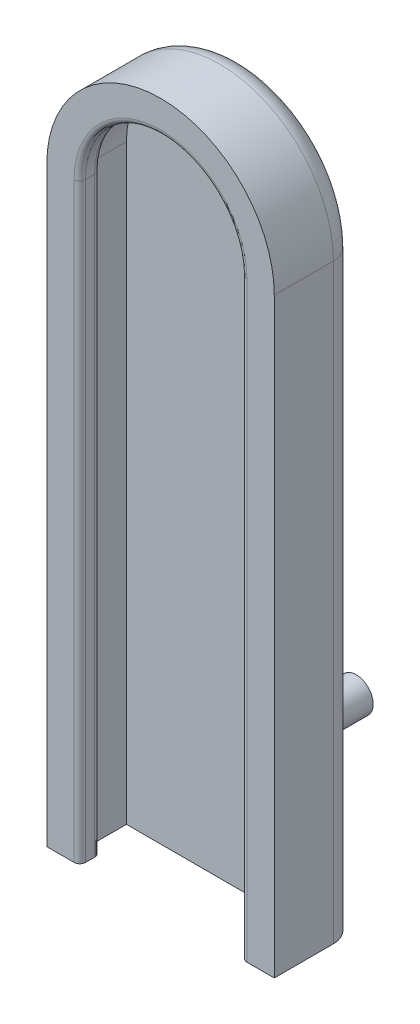
ISO-10303-21;
HEADER;
FILE_DESCRIPTION(('STEP AP214'),'2;1');
FILE_NAME('part.step','',(''),(''),'','','');
FILE_SCHEMA(('AUTOMOTIVE_DESIGN { 1 0 10303 214 1 1 1 1 }'));
ENDSEC;
DATA;
#1=APPLICATION_CONTEXT('core data for automotive mechanical design processes');
#2=APPLICATION_PROTOCOL_DEFINITION('international standard','automotive_design',2000,#1);
#3=PRODUCT_CONTEXT('',#1,'mechanical');
#4=PRODUCT('Part','Part','',(#3));
#5=PRODUCT_RELATED_PRODUCT_CATEGORY('part','',(#4));
#6=PRODUCT_DEFINITION_FORMATION('','',#4);
#7=PRODUCT_DEFINITION_CONTEXT('part definition',#1,'design');
#8=PRODUCT_DEFINITION('design','',#6,#7);
#9=PRODUCT_DEFINITION_SHAPE('','',#8);
#10=(LENGTH_UNIT() NAMED_UNIT(*) SI_UNIT(.MILLI.,.METRE.));
#11=(NAMED_UNIT(*) PLANE_ANGLE_UNIT() SI_UNIT($,.RADIAN.));
#12=(NAMED_UNIT(*) SI_UNIT($,.STERADIAN.) SOLID_ANGLE_UNIT());
#13=UNCERTAINTY_MEASURE_WITH_UNIT(LENGTH_MEASURE(1.E-05),#10,'distance_accuracy_value','');
#14=(GEOMETRIC_REPRESENTATION_CONTEXT(3) GLOBAL_UNCERTAINTY_ASSIGNED_CONTEXT((#13)) GLOBAL_UNIT_ASSIGNED_CONTEXT((#10,
#11,#12)) REPRESENTATION_CONTEXT('',''));
#15=CARTESIAN_POINT('',(0.,0.,0.));
#16=DIRECTION('',(0.,0.,1.));
#17=DIRECTION('',(1.,0.,0.));
#18=AXIS2_PLACEMENT_3D('',#15,#16,#17);
#19=CARTESIAN_POINT('',(0.,26.,0.));
#20=DIRECTION('',(0.,0.,-1.));
#21=DIRECTION('',(-1.,0.,0.));
#22=AXIS2_PLACEMENT_3D('',#19,#20,#21);
#23=PLANE('',#22);
#24=DIRECTION('',(1.,0.,0.));
#25=VECTOR('',#24,1.);
#26=CARTESIAN_POINT('',(0.,0.,0.));
#27=LINE('',#26,#25);
#28=CARTESIAN_POINT('',(1.,0.,0.));
#29=VERTEX_POINT('',#28);
#30=CARTESIAN_POINT('',(9.,0.,0.));
#31=VERTEX_POINT('',#30);
#32=EDGE_CURVE('E222',#29,#31,#27,.T.);
#33=ORIENTED_EDGE('',*,*,#32,.F.);
#34=DIRECTION('',(0.,-1.,0.));
#35=VECTOR('',#34,1.);
#36=CARTESIAN_POINT('',(1.,26.,0.));
#37=LINE('',#36,#35);
#38=CARTESIAN_POINT('',(1.,26.,0.));
#39=VERTEX_POINT('',#38);
#40=EDGE_CURVE('E56',#29,#39,#37,.F.);
#41=ORIENTED_EDGE('',*,*,#40,.T.);
#42=CARTESIAN_POINT('',(5.,26.,0.));
#43=DIRECTION('',(0.,0.,-1.));
#44=DIRECTION('',(-1.,0.,0.));
#45=AXIS2_PLACEMENT_3D('',#42,#43,#44);
#46=CIRCLE('',#45,4.);
#47=CARTESIAN_POINT('',(9.,26.,0.));
#48=VERTEX_POINT('',#47);
#49=EDGE_CURVE('E292',#39,#48,#46,.T.);
#50=ORIENTED_EDGE('',*,*,#49,.T.);
#51=DIRECTION('',(0.,1.,0.));
#52=VECTOR('',#51,1.);
#53=CARTESIAN_POINT('',(9.,0.,0.));
#54=LINE('',#53,#52);
#55=EDGE_CURVE('E290',#48,#31,#54,.F.);
#56=ORIENTED_EDGE('',*,*,#55,.T.);
#57=EDGE_LOOP('',(#33,#41,#50,#56));
#58=FACE_BOUND('',#57,.T.);
#59=CARTESIAN_POINT('',(5.,4.,0.));
#60=DIRECTION('',(0.,0.,-1.));
#61=DIRECTION('',(-1.,0.,0.));
#62=AXIS2_PLACEMENT_3D('',#59,#60,#61);
#63=CIRCLE('',#62,0.749999999999999);
#64=CARTESIAN_POINT('',(4.25,4.,0.));
#65=VERTEX_POINT('',#64);
#66=EDGE_CURVE('E303',#65,#65,#63,.T.);
#67=ORIENTED_EDGE('',*,*,#66,.F.);
#68=EDGE_LOOP('',(#67));
#69=FACE_BOUND('',#68,.T.);
#70=ADVANCED_FACE('F33',(#58,#69),#23,.T.);
#71=CARTESIAN_POINT('',(0.,0.,1.));
#72=DIRECTION('',(1.,0.,0.));
#73=DIRECTION('',(0.,0.,-1.));
#74=AXIS2_PLACEMENT_3D('',#71,#72,#73);
#75=PLANE('',#74);
#76=DIRECTION('',(0.,0.,-1.));
#77=VECTOR('',#76,1.);
#78=CARTESIAN_POINT('',(0.,26.,1.));
#79=LINE('',#78,#77);
#80=CARTESIAN_POINT('',(0.,26.,3.6));
#81=VERTEX_POINT('',#80);
#82=CARTESIAN_POINT('',(0.,26.,1.));
#83=VERTEX_POINT('',#82);
#84=EDGE_CURVE('E225',#81,#83,#79,.T.);
#85=ORIENTED_EDGE('',*,*,#84,.T.);
#86=DIRECTION('',(0.,-1.,0.));
#87=VECTOR('',#86,1.);
#88=CARTESIAN_POINT('',(0.,0.,1.));
#89=LINE('',#88,#87);
#90=CARTESIAN_POINT('',(0.,0.,1.));
#91=VERTEX_POINT('',#90);
#92=EDGE_CURVE('E271',#83,#91,#89,.T.);
#93=ORIENTED_EDGE('',*,*,#92,.T.);
#94=DIRECTION('',(0.,0.,-1.));
#95=VECTOR('',#94,1.);
#96=CARTESIAN_POINT('',(0.,0.,1.));
#97=LINE('',#96,#95);
#98=CARTESIAN_POINT('',(0.,0.,3.6));
#99=VERTEX_POINT('',#98);
#100=EDGE_CURVE('E234',#99,#91,#97,.T.);
#101=ORIENTED_EDGE('',*,*,#100,.F.);
#102=DIRECTION('',(0.,-1.,0.));
#103=VECTOR('',#102,1.);
#104=CARTESIAN_POINT('',(0.,26.,3.6));
#105=LINE('',#104,#103);
#106=EDGE_CURVE('E212',#81,#99,#105,.T.);
#107=ORIENTED_EDGE('',*,*,#106,.F.);
#108=EDGE_LOOP('',(#85,#93,#101,#107));
#109=FACE_BOUND('',#108,.T.);
#110=ADVANCED_FACE('F357',(#109),#75,.F.);
#111=CARTESIAN_POINT('',(0.,0.,1.));
#112=DIRECTION('',(0.,1.,0.));
#113=DIRECTION('',(0.,0.,1.));
#114=AXIS2_PLACEMENT_3D('',#111,#112,#113);
#115=PLANE('',#114);
#116=ORIENTED_EDGE('',*,*,#100,.T.);
#117=CARTESIAN_POINT('',(1.,0.,1.));
#118=DIRECTION('',(0.,1.,0.));
#119=DIRECTION('',(0.,0.,1.));
#120=AXIS2_PLACEMENT_3D('',#117,#118,#119);
#121=CIRCLE('',#120,1.);
#122=EDGE_CURVE('E288',#91,#29,#121,.F.);
#123=ORIENTED_EDGE('',*,*,#122,.T.);
#124=ORIENTED_EDGE('',*,*,#32,.T.);
#125=CARTESIAN_POINT('',(9.,0.,1.));
#126=DIRECTION('',(0.,1.,0.));
#127=DIRECTION('',(0.,0.,1.));
#128=AXIS2_PLACEMENT_3D('',#125,#126,#127);
#129=CIRCLE('',#128,1.);
#130=CARTESIAN_POINT('',(10.,0.,1.));
#131=VERTEX_POINT('',#130);
#132=EDGE_CURVE('E286',#31,#131,#129,.F.);
#133=ORIENTED_EDGE('',*,*,#132,.T.);
#134=DIRECTION('',(0.,0.,-1.));
#135=VECTOR('',#134,1.);
#136=CARTESIAN_POINT('',(10.,0.,1.));
#137=LINE('',#136,#135);
#138=CARTESIAN_POINT('',(10.,0.,3.6));
#139=VERTEX_POINT('',#138);
#140=EDGE_CURVE('E232',#139,#131,#137,.T.);
#141=ORIENTED_EDGE('',*,*,#140,.F.);
#142=DIRECTION('',(-1.,0.,0.));
#143=VECTOR('',#142,1.);
#144=CARTESIAN_POINT('',(10.,0.,3.6));
#145=LINE('',#144,#143);
#146=CARTESIAN_POINT('',(8.8,0.,3.6));
#147=VERTEX_POINT('',#146);
#148=EDGE_CURVE('E195',#139,#147,#145,.T.);
#149=ORIENTED_EDGE('',*,*,#148,.T.);
#150=CARTESIAN_POINT('',(8.8,0.,3.35));
#151=DIRECTION('',(0.,1.,0.));
#152=DIRECTION('',(0.,0.,1.));
#153=AXIS2_PLACEMENT_3D('',#150,#151,#152);
#154=CIRCLE('',#153,0.25);
#155=CARTESIAN_POINT('',(8.55,0.,3.35));
#156=VERTEX_POINT('',#155);
#157=EDGE_CURVE('E242',#147,#156,#154,.F.);
#158=ORIENTED_EDGE('',*,*,#157,.T.);
#159=DIRECTION('',(0.,0.,-1.));
#160=VECTOR('',#159,1.);
#161=CARTESIAN_POINT('',(8.55,0.,3.6));
#162=LINE('',#161,#160);
#163=CARTESIAN_POINT('',(8.55,0.,2.95));
#164=VERTEX_POINT('',#163);
#165=EDGE_CURVE('E201',#156,#164,#162,.T.);
#166=ORIENTED_EDGE('',*,*,#165,.T.);
#167=CARTESIAN_POINT('',(8.8,0.,2.95));
#168=DIRECTION('',(0.,1.,0.));
#169=DIRECTION('',(0.,0.,1.));
#170=AXIS2_PLACEMENT_3D('',#167,#168,#169);
#171=CIRCLE('',#170,0.25);
#172=CARTESIAN_POINT('',(8.8,0.,2.7));
#173=VERTEX_POINT('',#172);
#174=EDGE_CURVE('E248',#164,#173,#171,.F.);
#175=ORIENTED_EDGE('',*,*,#174,.T.);
#176=DIRECTION('',(-1.,0.,0.));
#177=VECTOR('',#176,1.);
#178=CARTESIAN_POINT('',(8.55,0.,2.7));
#179=LINE('',#178,#177);
#180=CARTESIAN_POINT('',(9.1,0.,2.7));
#181=VERTEX_POINT('',#180);
#182=EDGE_CURVE('E312',#181,#173,#179,.T.);
#183=ORIENTED_EDGE('',*,*,#182,.F.);
#184=DIRECTION('',(0.,0.,1.));
#185=VECTOR('',#184,1.);
#186=CARTESIAN_POINT('',(9.1,0.,1.));
#187=LINE('',#186,#185);
#188=CARTESIAN_POINT('',(9.1,0.,1.));
#189=VERTEX_POINT('',#188);
#190=EDGE_CURVE('E169',#189,#181,#187,.T.);
#191=ORIENTED_EDGE('',*,*,#190,.F.);
#192=DIRECTION('',(1.,0.,0.));
#193=VECTOR('',#192,1.);
#194=CARTESIAN_POINT('',(0.,0.,1.));
#195=LINE('',#194,#193);
#196=CARTESIAN_POINT('',(0.9,0.,1.));
#197=VERTEX_POINT('',#196);
#198=EDGE_CURVE('E223',#197,#189,#195,.T.);
#199=ORIENTED_EDGE('',*,*,#198,.F.);
#200=DIRECTION('',(0.,0.,-1.));
#201=VECTOR('',#200,1.);
#202=CARTESIAN_POINT('',(0.9,0.,1.));
#203=LINE('',#202,#201);
#204=CARTESIAN_POINT('',(0.9,0.,2.7));
#205=VERTEX_POINT('',#204);
#206=EDGE_CURVE('E186',#205,#197,#203,.T.);
#207=ORIENTED_EDGE('',*,*,#206,.F.);
#208=DIRECTION('',(-1.,0.,0.));
#209=VECTOR('',#208,1.);
#210=CARTESIAN_POINT('',(1.45,0.,2.7));
#211=LINE('',#210,#209);
#212=CARTESIAN_POINT('',(1.2,0.,2.7));
#213=VERTEX_POINT('',#212);
#214=EDGE_CURVE('E177',#213,#205,#211,.T.);
#215=ORIENTED_EDGE('',*,*,#214,.F.);
#216=CARTESIAN_POINT('',(1.2,0.,2.95));
#217=DIRECTION('',(0.,1.,0.));
#218=DIRECTION('',(0.,0.,1.));
#219=AXIS2_PLACEMENT_3D('',#216,#217,#218);
#220=CIRCLE('',#219,0.25);
#221=CARTESIAN_POINT('',(1.45,0.,2.95));
#222=VERTEX_POINT('',#221);
#223=EDGE_CURVE('E244',#213,#222,#220,.F.);
#224=ORIENTED_EDGE('',*,*,#223,.T.);
#225=DIRECTION('',(0.,0.,1.));
#226=VECTOR('',#225,1.);
#227=CARTESIAN_POINT('',(1.45,0.,3.6));
#228=LINE('',#227,#226);
#229=CARTESIAN_POINT('',(1.45,0.,3.35));
#230=VERTEX_POINT('',#229);
#231=EDGE_CURVE('E208',#222,#230,#228,.T.);
#232=ORIENTED_EDGE('',*,*,#231,.T.);
#233=CARTESIAN_POINT('',(1.2,0.,3.35));
#234=DIRECTION('',(0.,1.,0.));
#235=DIRECTION('',(0.,0.,1.));
#236=AXIS2_PLACEMENT_3D('',#233,#234,#235);
#237=CIRCLE('',#236,0.25);
#238=CARTESIAN_POINT('',(1.2,0.,3.6));
#239=VERTEX_POINT('',#238);
#240=EDGE_CURVE('E246',#230,#239,#237,.F.);
#241=ORIENTED_EDGE('',*,*,#240,.T.);
#242=DIRECTION('',(-1.,0.,0.));
#243=VECTOR('',#242,1.);
#244=CARTESIAN_POINT('',(0.,0.,3.6));
#245=LINE('',#244,#243);
#246=EDGE_CURVE('E213',#239,#99,#245,.T.);
#247=ORIENTED_EDGE('',*,*,#246,.T.);
#248=EDGE_LOOP('',(#116,#123,#124,#133,#141,#149,#158,#166,#175,#183,#191,#199,#207,#215,#224,
#232,#241,#247));
#249=FACE_BOUND('',#248,.T.);
#250=ADVANCED_FACE('F323',(#249),#115,.F.);
#251=CARTESIAN_POINT('',(10.,0.,1.));
#252=DIRECTION('',(-1.,0.,0.));
#253=DIRECTION('',(0.,0.,1.));
#254=AXIS2_PLACEMENT_3D('',#251,#252,#253);
#255=PLANE('',#254);
#256=ORIENTED_EDGE('',*,*,#140,.T.);
#257=DIRECTION('',(0.,1.,0.));
#258=VECTOR('',#257,1.);
#259=CARTESIAN_POINT('',(10.,26.,1.));
#260=LINE('',#259,#258);
#261=CARTESIAN_POINT('',(10.,26.,1.));
#262=VERTEX_POINT('',#261);
#263=EDGE_CURVE('E11',#131,#262,#260,.T.);
#264=ORIENTED_EDGE('',*,*,#263,.T.);
#265=DIRECTION('',(0.,0.,-1.));
#266=VECTOR('',#265,1.);
#267=CARTESIAN_POINT('',(10.,26.,1.));
#268=LINE('',#267,#266);
#269=CARTESIAN_POINT('',(10.,26.,3.6));
#270=VERTEX_POINT('',#269);
#271=EDGE_CURVE('E230',#270,#262,#268,.T.);
#272=ORIENTED_EDGE('',*,*,#271,.F.);
#273=DIRECTION('',(0.,-1.,0.));
#274=VECTOR('',#273,1.);
#275=CARTESIAN_POINT('',(10.,26.,3.6));
#276=LINE('',#275,#274);
#277=EDGE_CURVE('E200',#270,#139,#276,.T.);
#278=ORIENTED_EDGE('',*,*,#277,.T.);
#279=EDGE_LOOP('',(#256,#264,#272,#278));
#280=FACE_BOUND('',#279,.T.);
#281=ADVANCED_FACE('F385',(#280),#255,.F.);
#282=CARTESIAN_POINT('',(0.,26.,1.));
#283=DIRECTION('',(0.,0.,-1.));
#284=DIRECTION('',(-1.,0.,0.));
#285=AXIS2_PLACEMENT_3D('',#282,#283,#284);
#286=PLANE('',#285);
#287=ORIENTED_EDGE('',*,*,#198,.T.);
#288=DIRECTION('',(0.,-1.,0.));
#289=VECTOR('',#288,1.);
#290=CARTESIAN_POINT('',(9.1,26.,1.));
#291=LINE('',#290,#289);
#292=CARTESIAN_POINT('',(9.1,26.,1.));
#293=VERTEX_POINT('',#292);
#294=EDGE_CURVE('E191',#293,#189,#291,.T.);
#295=ORIENTED_EDGE('',*,*,#294,.F.);
#296=CARTESIAN_POINT('',(5.,26.,1.));
#297=DIRECTION('',(0.,0.,1.));
#298=DIRECTION('',(-1.,0.,0.));
#299=AXIS2_PLACEMENT_3D('',#296,#297,#298);
#300=CIRCLE('',#299,4.1);
#301=CARTESIAN_POINT('',(0.9,26.,1.));
#302=VERTEX_POINT('',#301);
#303=EDGE_CURVE('E170',#293,#302,#300,.T.);
#304=ORIENTED_EDGE('',*,*,#303,.T.);
#305=DIRECTION('',(0.,-1.,0.));
#306=VECTOR('',#305,1.);
#307=CARTESIAN_POINT('',(0.9,26.,1.));
#308=LINE('',#307,#306);
#309=EDGE_CURVE('E181',#302,#197,#308,.T.);
#310=ORIENTED_EDGE('',*,*,#309,.T.);
#311=EDGE_LOOP('',(#287,#295,#304,#310));
#312=FACE_BOUND('',#311,.T.);
#313=ADVANCED_FACE('F383',(#312),#286,.F.);
#314=CARTESIAN_POINT('',(5.,26.,3.6));
#315=DIRECTION('',(0.,0.,-1.));
#316=DIRECTION('',(-1.,0.,0.));
#317=AXIS2_PLACEMENT_3D('',#314,#315,#316);
#318=CYLINDRICAL_SURFACE('',#317,5.);
#319=ORIENTED_EDGE('',*,*,#271,.T.);
#320=CARTESIAN_POINT('',(5.,26.,1.));
#321=DIRECTION('',(0.,0.,-1.));
#322=DIRECTION('',(-1.,0.,0.));
#323=AXIS2_PLACEMENT_3D('',#320,#321,#322);
#324=CIRCLE('',#323,5.);
#325=EDGE_CURVE('E42',#262,#83,#324,.F.);
#326=ORIENTED_EDGE('',*,*,#325,.T.);
#327=ORIENTED_EDGE('',*,*,#84,.F.);
#328=CARTESIAN_POINT('',(5.,26.,3.6));
#329=DIRECTION('',(0.,0.,-1.));
#330=DIRECTION('',(-1.,0.,0.));
#331=AXIS2_PLACEMENT_3D('',#328,#329,#330);
#332=CIRCLE('',#331,5.);
#333=EDGE_CURVE('E219',#81,#270,#332,.T.);
#334=ORIENTED_EDGE('',*,*,#333,.T.);
#335=EDGE_LOOP('',(#319,#326,#327,#334));
#336=FACE_BOUND('',#335,.T.);
#337=ADVANCED_FACE('F420',(#336),#318,.T.);
#338=CARTESIAN_POINT('',(5.,26.,3.6));
#339=DIRECTION('',(0.,0.,-1.));
#340=DIRECTION('',(-1.,0.,0.));
#341=AXIS2_PLACEMENT_3D('',#338,#339,#340);
#342=PLANE('',#341);
#343=ORIENTED_EDGE('',*,*,#246,.F.);
#344=DIRECTION('',(0.,-1.,0.));
#345=VECTOR('',#344,1.);
#346=CARTESIAN_POINT('',(1.2,26.,3.6));
#347=LINE('',#346,#345);
#348=CARTESIAN_POINT('',(1.2,26.,3.6));
#349=VERTEX_POINT('',#348);
#350=EDGE_CURVE('E269',#239,#349,#347,.F.);
#351=ORIENTED_EDGE('',*,*,#350,.T.);
#352=CARTESIAN_POINT('',(5.,26.,3.6));
#353=DIRECTION('',(0.,0.,-1.));
#354=DIRECTION('',(-1.,0.,0.));
#355=AXIS2_PLACEMENT_3D('',#352,#353,#354);
#356=CIRCLE('',#355,3.8);
#357=CARTESIAN_POINT('',(8.8,26.,3.6));
#358=VERTEX_POINT('',#357);
#359=EDGE_CURVE('E267',#349,#358,#356,.T.);
#360=ORIENTED_EDGE('',*,*,#359,.T.);
#361=DIRECTION('',(0.,-1.,0.));
#362=VECTOR('',#361,1.);
#363=CARTESIAN_POINT('',(8.8,0.,3.6));
#364=LINE('',#363,#362);
#365=EDGE_CURVE('E265',#358,#147,#364,.T.);
#366=ORIENTED_EDGE('',*,*,#365,.T.);
#367=ORIENTED_EDGE('',*,*,#148,.F.);
#368=ORIENTED_EDGE('',*,*,#277,.F.);
#369=ORIENTED_EDGE('',*,*,#333,.F.);
#370=ORIENTED_EDGE('',*,*,#106,.T.);
#371=EDGE_LOOP('',(#343,#351,#360,#366,#367,#368,#369,#370));
#372=FACE_BOUND('',#371,.T.);
#373=ADVANCED_FACE('F351',(#372),#342,.F.);
#374=CARTESIAN_POINT('',(1.45,26.,3.6));
#375=DIRECTION('',(1.,0.,0.));
#376=DIRECTION('',(0.,0.,-1.));
#377=AXIS2_PLACEMENT_3D('',#374,#375,#376);
#378=PLANE('',#377);
#379=DIRECTION('',(0.,0.,1.));
#380=VECTOR('',#379,1.);
#381=CARTESIAN_POINT('',(1.45,26.,3.6));
#382=LINE('',#381,#380);
#383=CARTESIAN_POINT('',(1.45,26.,2.95));
#384=VERTEX_POINT('',#383);
#385=CARTESIAN_POINT('',(1.45,26.,3.35));
#386=VERTEX_POINT('',#385);
#387=EDGE_CURVE('E209',#384,#386,#382,.T.);
#388=ORIENTED_EDGE('',*,*,#387,.T.);
#389=DIRECTION('',(0.,-1.,0.));
#390=VECTOR('',#389,1.);
#391=CARTESIAN_POINT('',(1.45,0.,3.35));
#392=LINE('',#391,#390);
#393=EDGE_CURVE('E262',#386,#230,#392,.T.);
#394=ORIENTED_EDGE('',*,*,#393,.T.);
#395=ORIENTED_EDGE('',*,*,#231,.F.);
#396=DIRECTION('',(0.,-1.,0.));
#397=VECTOR('',#396,1.);
#398=CARTESIAN_POINT('',(1.45,26.,2.95));
#399=LINE('',#398,#397);
#400=EDGE_CURVE('E260',#222,#384,#399,.F.);
#401=ORIENTED_EDGE('',*,*,#400,.T.);
#402=EDGE_LOOP('',(#388,#394,#395,#401));
#403=FACE_BOUND('',#402,.T.);
#404=ADVANCED_FACE('F341',(#403),#378,.T.);
#405=CARTESIAN_POINT('',(8.55,26.,3.6));
#406=DIRECTION('',(-1.,0.,0.));
#407=DIRECTION('',(0.,0.,1.));
#408=AXIS2_PLACEMENT_3D('',#405,#406,#407);
#409=PLANE('',#408);
#410=DIRECTION('',(0.,0.,-1.));
#411=VECTOR('',#410,1.);
#412=CARTESIAN_POINT('',(8.55,26.,3.6));
#413=LINE('',#412,#411);
#414=CARTESIAN_POINT('',(8.55,26.,3.35));
#415=VERTEX_POINT('',#414);
#416=CARTESIAN_POINT('',(8.55,26.,2.95));
#417=VERTEX_POINT('',#416);
#418=EDGE_CURVE('E197',#415,#417,#413,.T.);
#419=ORIENTED_EDGE('',*,*,#418,.T.);
#420=DIRECTION('',(0.,-1.,0.));
#421=VECTOR('',#420,1.);
#422=CARTESIAN_POINT('',(8.55,0.,2.95));
#423=LINE('',#422,#421);
#424=EDGE_CURVE('E239',#417,#164,#423,.T.);
#425=ORIENTED_EDGE('',*,*,#424,.T.);
#426=ORIENTED_EDGE('',*,*,#165,.F.);
#427=DIRECTION('',(0.,-1.,0.));
#428=VECTOR('',#427,1.);
#429=CARTESIAN_POINT('',(8.55,26.,3.35));
#430=LINE('',#429,#428);
#431=EDGE_CURVE('E237',#156,#415,#430,.F.);
#432=ORIENTED_EDGE('',*,*,#431,.T.);
#433=EDGE_LOOP('',(#419,#425,#426,#432));
#434=FACE_BOUND('',#433,.T.);
#435=ADVANCED_FACE('F413',(#434),#409,.T.);
#436=CARTESIAN_POINT('',(0.9,26.,1.));
#437=DIRECTION('',(-1.,0.,0.));
#438=DIRECTION('',(0.,0.,1.));
#439=AXIS2_PLACEMENT_3D('',#436,#437,#438);
#440=PLANE('',#439);
#441=ORIENTED_EDGE('',*,*,#206,.T.);
#442=ORIENTED_EDGE('',*,*,#309,.F.);
#443=DIRECTION('',(0.,0.,-1.));
#444=VECTOR('',#443,1.);
#445=CARTESIAN_POINT('',(0.9,26.,1.));
#446=LINE('',#445,#444);
#447=CARTESIAN_POINT('',(0.9,26.,2.7));
#448=VERTEX_POINT('',#447);
#449=EDGE_CURVE('E163',#448,#302,#446,.T.);
#450=ORIENTED_EDGE('',*,*,#449,.F.);
#451=DIRECTION('',(0.,-1.,0.));
#452=VECTOR('',#451,1.);
#453=CARTESIAN_POINT('',(0.9,26.,2.7));
#454=LINE('',#453,#452);
#455=EDGE_CURVE('E173',#448,#205,#454,.T.);
#456=ORIENTED_EDGE('',*,*,#455,.T.);
#457=EDGE_LOOP('',(#441,#442,#450,#456));
#458=FACE_BOUND('',#457,.T.);
#459=ADVANCED_FACE('F184',(#458),#440,.F.);
#460=CARTESIAN_POINT('',(1.45,26.,2.7));
#461=DIRECTION('',(0.,0.,1.));
#462=DIRECTION('',(1.,0.,0.));
#463=AXIS2_PLACEMENT_3D('',#460,#461,#462);
#464=PLANE('',#463);
#465=ORIENTED_EDGE('',*,*,#182,.T.);
#466=DIRECTION('',(0.,-1.,0.));
#467=VECTOR('',#466,1.);
#468=CARTESIAN_POINT('',(8.8,26.,2.7));
#469=LINE('',#468,#467);
#470=CARTESIAN_POINT('',(8.8,26.,2.7));
#471=VERTEX_POINT('',#470);
#472=EDGE_CURVE('E254',#173,#471,#469,.F.);
#473=ORIENTED_EDGE('',*,*,#472,.T.);
#474=CARTESIAN_POINT('',(5.,26.,2.7));
#475=DIRECTION('',(0.,0.,1.));
#476=DIRECTION('',(1.,0.,0.));
#477=AXIS2_PLACEMENT_3D('',#474,#475,#476);
#478=CIRCLE('',#477,3.8);
#479=CARTESIAN_POINT('',(1.2,26.,2.7));
#480=VERTEX_POINT('',#479);
#481=EDGE_CURVE('E252',#471,#480,#478,.T.);
#482=ORIENTED_EDGE('',*,*,#481,.T.);
#483=DIRECTION('',(0.,-1.,0.));
#484=VECTOR('',#483,1.);
#485=CARTESIAN_POINT('',(1.2,0.,2.7));
#486=LINE('',#485,#484);
#487=EDGE_CURVE('E250',#480,#213,#486,.T.);
#488=ORIENTED_EDGE('',*,*,#487,.T.);
#489=ORIENTED_EDGE('',*,*,#214,.T.);
#490=ORIENTED_EDGE('',*,*,#455,.F.);
#491=CARTESIAN_POINT('',(5.,26.,2.7));
#492=DIRECTION('',(0.,0.,1.));
#493=DIRECTION('',(-1.,0.,0.));
#494=AXIS2_PLACEMENT_3D('',#491,#492,#493);
#495=CIRCLE('',#494,4.1);
#496=CARTESIAN_POINT('',(9.1,26.,2.7));
#497=VERTEX_POINT('',#496);
#498=EDGE_CURVE('E159',#497,#448,#495,.T.);
#499=ORIENTED_EDGE('',*,*,#498,.F.);
#500=DIRECTION('',(0.,-1.,0.));
#501=VECTOR('',#500,1.);
#502=CARTESIAN_POINT('',(9.1,26.,2.7));
#503=LINE('',#502,#501);
#504=EDGE_CURVE('E193',#497,#181,#503,.T.);
#505=ORIENTED_EDGE('',*,*,#504,.T.);
#506=EDGE_LOOP('',(#465,#473,#482,#488,#489,#490,#499,#505));
#507=FACE_BOUND('',#506,.T.);
#508=ADVANCED_FACE('F175',(#507),#464,.F.);
#509=CARTESIAN_POINT('',(9.1,26.,1.));
#510=DIRECTION('',(1.,0.,0.));
#511=DIRECTION('',(0.,0.,-1.));
#512=AXIS2_PLACEMENT_3D('',#509,#510,#511);
#513=PLANE('',#512);
#514=ORIENTED_EDGE('',*,*,#190,.T.);
#515=ORIENTED_EDGE('',*,*,#504,.F.);
#516=DIRECTION('',(0.,0.,1.));
#517=VECTOR('',#516,1.);
#518=CARTESIAN_POINT('',(9.1,26.,1.));
#519=LINE('',#518,#517);
#520=EDGE_CURVE('E166',#293,#497,#519,.T.);
#521=ORIENTED_EDGE('',*,*,#520,.F.);
#522=ORIENTED_EDGE('',*,*,#294,.T.);
#523=EDGE_LOOP('',(#514,#515,#521,#522));
#524=FACE_BOUND('',#523,.T.);
#525=ADVANCED_FACE('F319',(#524),#513,.F.);
#526=CARTESIAN_POINT('',(5.,26.,2.7));
#527=DIRECTION('',(0.,0.,1.));
#528=DIRECTION('',(1.,0.,0.));
#529=AXIS2_PLACEMENT_3D('',#526,#527,#528);
#530=CYLINDRICAL_SURFACE('',#529,3.55);
#531=ORIENTED_EDGE('',*,*,#387,.F.);
#532=CARTESIAN_POINT('',(5.,26.,2.95));
#533=DIRECTION('',(0.,0.,1.));
#534=DIRECTION('',(1.,0.,0.));
#535=AXIS2_PLACEMENT_3D('',#532,#533,#534);
#536=CIRCLE('',#535,3.55);
#537=EDGE_CURVE('E258',#384,#417,#536,.F.);
#538=ORIENTED_EDGE('',*,*,#537,.T.);
#539=ORIENTED_EDGE('',*,*,#418,.F.);
#540=CARTESIAN_POINT('',(5.,26.,3.35));
#541=DIRECTION('',(0.,0.,-1.));
#542=DIRECTION('',(-1.,0.,0.));
#543=AXIS2_PLACEMENT_3D('',#540,#541,#542);
#544=CIRCLE('',#543,3.55);
#545=EDGE_CURVE('E256',#415,#386,#544,.F.);
#546=ORIENTED_EDGE('',*,*,#545,.T.);
#547=EDGE_LOOP('',(#531,#538,#539,#546));
#548=FACE_BOUND('',#547,.T.);
#549=ADVANCED_FACE('F416',(#548),#530,.F.);
#550=CARTESIAN_POINT('',(5.,26.,2.7));
#551=DIRECTION('',(0.,0.,-1.));
#552=DIRECTION('',(-1.,0.,0.));
#553=AXIS2_PLACEMENT_3D('',#550,#551,#552);
#554=CYLINDRICAL_SURFACE('',#553,4.1);
#555=ORIENTED_EDGE('',*,*,#303,.F.);
#556=ORIENTED_EDGE('',*,*,#520,.T.);
#557=ORIENTED_EDGE('',*,*,#498,.T.);
#558=ORIENTED_EDGE('',*,*,#449,.T.);
#559=EDGE_LOOP('',(#555,#556,#557,#558));
#560=FACE_BOUND('',#559,.T.);
#561=ADVANCED_FACE('F161',(#560),#554,.F.);
#562=CARTESIAN_POINT('',(1.2,26.,2.95));
#563=DIRECTION('',(0.,1.,0.));
#564=DIRECTION('',(0.,0.,1.));
#565=AXIS2_PLACEMENT_3D('',#562,#563,#564);
#566=CYLINDRICAL_SURFACE('',#565,0.25);
#567=ORIENTED_EDGE('',*,*,#223,.F.);
#568=ORIENTED_EDGE('',*,*,#487,.F.);
#569=CARTESIAN_POINT('',(1.2,26.,2.95));
#570=DIRECTION('',(0.,1.,0.));
#571=DIRECTION('',(0.,0.,1.));
#572=AXIS2_PLACEMENT_3D('',#569,#570,#571);
#573=CIRCLE('',#572,0.25);
#574=EDGE_CURVE('E275',#384,#480,#573,.T.);
#575=ORIENTED_EDGE('',*,*,#574,.F.);
#576=ORIENTED_EDGE('',*,*,#400,.F.);
#577=EDGE_LOOP('',(#567,#568,#575,#576));
#578=FACE_BOUND('',#577,.T.);
#579=ADVANCED_FACE('F337',(#578),#566,.T.);
#580=CARTESIAN_POINT('',(5.,26.,2.95));
#581=DIRECTION('',(0.,0.,1.));
#582=DIRECTION('',(1.,0.,0.));
#583=AXIS2_PLACEMENT_3D('',#580,#581,#582);
#584=TOROIDAL_SURFACE('',#583,3.8,0.25);
#585=ORIENTED_EDGE('',*,*,#574,.T.);
#586=ORIENTED_EDGE('',*,*,#481,.F.);
#587=CARTESIAN_POINT('',(8.8,26.,2.95));
#588=DIRECTION('',(0.,-1.,0.));
#589=DIRECTION('',(0.,0.,-1.));
#590=AXIS2_PLACEMENT_3D('',#587,#588,#589);
#591=CIRCLE('',#590,0.25);
#592=EDGE_CURVE('E272',#417,#471,#591,.T.);
#593=ORIENTED_EDGE('',*,*,#592,.F.);
#594=ORIENTED_EDGE('',*,*,#537,.F.);
#595=EDGE_LOOP('',(#585,#586,#593,#594));
#596=FACE_BOUND('',#595,.T.);
#597=ADVANCED_FACE('F332',(#596),#584,.T.);
#598=CARTESIAN_POINT('',(8.8,26.,2.95));
#599=DIRECTION('',(0.,1.,0.));
#600=DIRECTION('',(0.,0.,1.));
#601=AXIS2_PLACEMENT_3D('',#598,#599,#600);
#602=CYLINDRICAL_SURFACE('',#601,0.25);
#603=ORIENTED_EDGE('',*,*,#592,.T.);
#604=ORIENTED_EDGE('',*,*,#472,.F.);
#605=ORIENTED_EDGE('',*,*,#174,.F.);
#606=ORIENTED_EDGE('',*,*,#424,.F.);
#607=EDGE_LOOP('',(#603,#604,#605,#606));
#608=FACE_BOUND('',#607,.T.);
#609=ADVANCED_FACE('F327',(#608),#602,.T.);
#610=CARTESIAN_POINT('',(8.8,26.,3.35));
#611=DIRECTION('',(0.,1.,0.));
#612=DIRECTION('',(0.,0.,1.));
#613=AXIS2_PLACEMENT_3D('',#610,#611,#612);
#614=CYLINDRICAL_SURFACE('',#613,0.25);
#615=ORIENTED_EDGE('',*,*,#157,.F.);
#616=ORIENTED_EDGE('',*,*,#365,.F.);
#617=CARTESIAN_POINT('',(8.8,26.,3.35));
#618=DIRECTION('',(0.,1.,0.));
#619=DIRECTION('',(0.,0.,1.));
#620=AXIS2_PLACEMENT_3D('',#617,#618,#619);
#621=CIRCLE('',#620,0.25);
#622=EDGE_CURVE('E276',#415,#358,#621,.T.);
#623=ORIENTED_EDGE('',*,*,#622,.F.);
#624=ORIENTED_EDGE('',*,*,#431,.F.);
#625=EDGE_LOOP('',(#615,#616,#623,#624));
#626=FACE_BOUND('',#625,.T.);
#627=ADVANCED_FACE('F392',(#626),#614,.T.);
#628=CARTESIAN_POINT('',(5.,26.,3.35));
#629=DIRECTION('',(0.,0.,-1.));
#630=DIRECTION('',(-1.,0.,0.));
#631=AXIS2_PLACEMENT_3D('',#628,#629,#630);
#632=TOROIDAL_SURFACE('',#631,3.8,0.25);
#633=ORIENTED_EDGE('',*,*,#622,.T.);
#634=ORIENTED_EDGE('',*,*,#359,.F.);
#635=CARTESIAN_POINT('',(1.2,26.,3.35));
#636=DIRECTION('',(0.,-1.,0.));
#637=DIRECTION('',(0.,0.,-1.));
#638=AXIS2_PLACEMENT_3D('',#635,#636,#637);
#639=CIRCLE('',#638,0.25);
#640=EDGE_CURVE('E279',#386,#349,#639,.T.);
#641=ORIENTED_EDGE('',*,*,#640,.F.);
#642=ORIENTED_EDGE('',*,*,#545,.F.);
#643=EDGE_LOOP('',(#633,#634,#641,#642));
#644=FACE_BOUND('',#643,.T.);
#645=ADVANCED_FACE('F399',(#644),#632,.T.);
#646=CARTESIAN_POINT('',(1.2,26.,3.35));
#647=DIRECTION('',(0.,1.,0.));
#648=DIRECTION('',(0.,0.,1.));
#649=AXIS2_PLACEMENT_3D('',#646,#647,#648);
#650=CYLINDRICAL_SURFACE('',#649,0.25);
#651=ORIENTED_EDGE('',*,*,#640,.T.);
#652=ORIENTED_EDGE('',*,*,#350,.F.);
#653=ORIENTED_EDGE('',*,*,#240,.F.);
#654=ORIENTED_EDGE('',*,*,#393,.F.);
#655=EDGE_LOOP('',(#651,#652,#653,#654));
#656=FACE_BOUND('',#655,.T.);
#657=ADVANCED_FACE('F346',(#656),#650,.T.);
#658=CARTESIAN_POINT('',(9.,0.,1.));
#659=DIRECTION('',(0.,-1.,0.));
#660=DIRECTION('',(0.,0.,-1.));
#661=AXIS2_PLACEMENT_3D('',#658,#659,#660);
#662=CYLINDRICAL_SURFACE('',#661,1.);
#663=ORIENTED_EDGE('',*,*,#132,.F.);
#664=ORIENTED_EDGE('',*,*,#55,.F.);
#665=CARTESIAN_POINT('',(9.,26.,1.));
#666=DIRECTION('',(0.,1.,0.));
#667=DIRECTION('',(0.,0.,1.));
#668=AXIS2_PLACEMENT_3D('',#665,#666,#667);
#669=CIRCLE('',#668,1.);
#670=EDGE_CURVE('E37',#262,#48,#669,.T.);
#671=ORIENTED_EDGE('',*,*,#670,.F.);
#672=ORIENTED_EDGE('',*,*,#263,.F.);
#673=EDGE_LOOP('',(#663,#664,#671,#672));
#674=FACE_BOUND('',#673,.T.);
#675=ADVANCED_FACE('F35',(#674),#662,.T.);
#676=CARTESIAN_POINT('',(5.,26.,1.));
#677=DIRECTION('',(0.,0.,-1.));
#678=DIRECTION('',(-1.,0.,0.));
#679=AXIS2_PLACEMENT_3D('',#676,#677,#678);
#680=TOROIDAL_SURFACE('',#679,4.,1.);
#681=ORIENTED_EDGE('',*,*,#670,.T.);
#682=ORIENTED_EDGE('',*,*,#49,.F.);
#683=CARTESIAN_POINT('',(1.,26.,1.));
#684=DIRECTION('',(0.,-1.,0.));
#685=DIRECTION('',(0.,0.,-1.));
#686=AXIS2_PLACEMENT_3D('',#683,#684,#685);
#687=CIRCLE('',#686,1.);
#688=EDGE_CURVE('E295',#83,#39,#687,.T.);
#689=ORIENTED_EDGE('',*,*,#688,.F.);
#690=ORIENTED_EDGE('',*,*,#325,.F.);
#691=EDGE_LOOP('',(#681,#682,#689,#690));
#692=FACE_BOUND('',#691,.T.);
#693=ADVANCED_FACE('F364',(#692),#680,.T.);
#694=CARTESIAN_POINT('',(1.,0.,1.));
#695=DIRECTION('',(0.,1.,0.));
#696=DIRECTION('',(0.,0.,1.));
#697=AXIS2_PLACEMENT_3D('',#694,#695,#696);
#698=CYLINDRICAL_SURFACE('',#697,1.);
#699=ORIENTED_EDGE('',*,*,#688,.T.);
#700=ORIENTED_EDGE('',*,*,#40,.F.);
#701=ORIENTED_EDGE('',*,*,#122,.F.);
#702=ORIENTED_EDGE('',*,*,#92,.F.);
#703=EDGE_LOOP('',(#699,#700,#701,#702));
#704=FACE_BOUND('',#703,.T.);
#705=ADVANCED_FACE('F361',(#704),#698,.T.);
#706=CARTESIAN_POINT('',(5.,4.,-5.));
#707=DIRECTION('',(0.,0.,1.));
#708=DIRECTION('',(1.,0.,0.));
#709=AXIS2_PLACEMENT_3D('',#706,#707,#708);
#710=CYLINDRICAL_SURFACE('',#709,0.749999999999999);
#711=CARTESIAN_POINT('',(5.,4.,-5.));
#712=DIRECTION('',(0.,0.,-1.));
#713=DIRECTION('',(-1.,0.,0.));
#714=AXIS2_PLACEMENT_3D('',#711,#712,#713);
#715=CIRCLE('',#714,0.749999999999999);
#716=CARTESIAN_POINT('',(4.25,4.,-5.));
#717=VERTEX_POINT('',#716);
#718=EDGE_CURVE('E297',#717,#717,#715,.T.);
#719=ORIENTED_EDGE('',*,*,#718,.F.);
#720=EDGE_LOOP('',(#719));
#721=FACE_BOUND('',#720,.T.);
#722=ORIENTED_EDGE('',*,*,#66,.T.);
#723=EDGE_LOOP('',(#722));
#724=FACE_BOUND('',#723,.T.);
#725=ADVANCED_FACE('F363',(#721,#724),#710,.T.);
#726=CARTESIAN_POINT('',(5.,4.,-5.));
#727=DIRECTION('',(0.,0.,-1.));
#728=DIRECTION('',(-1.,0.,0.));
#729=AXIS2_PLACEMENT_3D('',#726,#727,#728);
#730=PLANE('',#729);
#731=ORIENTED_EDGE('',*,*,#718,.T.);
#732=EDGE_LOOP('',(#731));
#733=FACE_BOUND('',#732,.T.);
#734=ADVANCED_FACE('F370',(#733),#730,.T.);
#735=CLOSED_SHELL('',(#70,#110,#250,#281,#313,#337,#373,#404,#435,#459,#508,#525,#549,#561,#579,
#597,#609,#627,#645,#657,#675,#693,#705,#725,#734));
#736=MANIFOLD_SOLID_BREP('B2',#735);
#737=ADVANCED_BREP_SHAPE_REPRESENTATION('',(#18,#736),#14);
#738=SHAPE_DEFINITION_REPRESENTATION(#9,#737);
ENDSEC;
END-ISO-10303-21;
